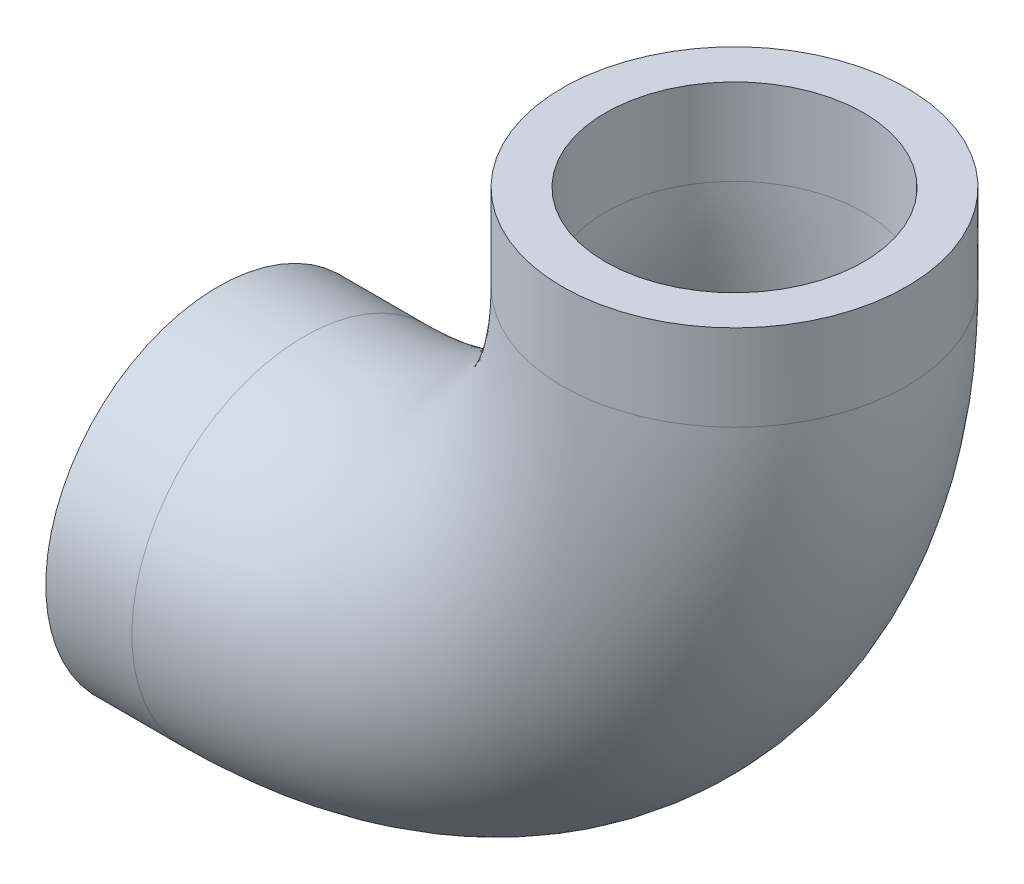
ISO-10303-21;
HEADER;
FILE_DESCRIPTION(('STEP AP214'),'2;1');
FILE_NAME('part.step','',(''),(''),'','','');
FILE_SCHEMA(('AUTOMOTIVE_DESIGN { 1 0 10303 214 1 1 1 1 }'));
ENDSEC;
DATA;
#1=APPLICATION_CONTEXT('core data for automotive mechanical design processes');
#2=APPLICATION_PROTOCOL_DEFINITION('international standard','automotive_design',2000,#1);
#3=PRODUCT_CONTEXT('',#1,'mechanical');
#4=PRODUCT('Part','Part','',(#3));
#5=PRODUCT_RELATED_PRODUCT_CATEGORY('part','',(#4));
#6=PRODUCT_DEFINITION_FORMATION('','',#4);
#7=PRODUCT_DEFINITION_CONTEXT('part definition',#1,'design');
#8=PRODUCT_DEFINITION('design','',#6,#7);
#9=PRODUCT_DEFINITION_SHAPE('','',#8);
#10=(LENGTH_UNIT() NAMED_UNIT(*) SI_UNIT(.MILLI.,.METRE.));
#11=(NAMED_UNIT(*) PLANE_ANGLE_UNIT() SI_UNIT($,.RADIAN.));
#12=(NAMED_UNIT(*) SI_UNIT($,.STERADIAN.) SOLID_ANGLE_UNIT());
#13=UNCERTAINTY_MEASURE_WITH_UNIT(LENGTH_MEASURE(1.E-05),#10,'distance_accuracy_value','');
#14=(GEOMETRIC_REPRESENTATION_CONTEXT(3) GLOBAL_UNCERTAINTY_ASSIGNED_CONTEXT((#13)) GLOBAL_UNIT_ASSIGNED_CONTEXT((#10,
#11,#12)) REPRESENTATION_CONTEXT('',''));
#15=CARTESIAN_POINT('',(0.,0.,0.));
#16=DIRECTION('',(0.,0.,1.));
#17=DIRECTION('',(1.,0.,0.));
#18=AXIS2_PLACEMENT_3D('',#15,#16,#17);
#19=CARTESIAN_POINT('',(6.35,31.75,0.));
#20=DIRECTION('',(0.,0.,1.));
#21=DIRECTION('',(0.,1.,0.));
#22=AXIS2_PLACEMENT_3D('',#19,#20,#21);
#23=TOROIDAL_SURFACE('',#22,31.75,9.525);
#24=CARTESIAN_POINT('',(38.1,31.75,0.));
#25=DIRECTION('',(0.,1.,0.));
#26=DIRECTION('',(0.,0.,1.));
#27=AXIS2_PLACEMENT_3D('',#24,#25,#26);
#28=CIRCLE('',#27,9.525);
#29=CARTESIAN_POINT('',(38.1,31.75,9.525));
#30=VERTEX_POINT('',#29);
#31=EDGE_CURVE('E34',#30,#30,#28,.T.);
#32=ORIENTED_EDGE('',*,*,#31,.T.);
#33=EDGE_LOOP('',(#32));
#34=FACE_BOUND('',#33,.T.);
#35=CARTESIAN_POINT('',(6.35,0.,0.));
#36=DIRECTION('',(1.,0.,0.));
#37=DIRECTION('',(0.,0.,-1.));
#38=AXIS2_PLACEMENT_3D('',#35,#36,#37);
#39=CIRCLE('',#38,9.525);
#40=CARTESIAN_POINT('',(6.35,0.,-9.525));
#41=VERTEX_POINT('',#40);
#42=EDGE_CURVE('E32',#41,#41,#39,.F.);
#43=ORIENTED_EDGE('',*,*,#42,.T.);
#44=EDGE_LOOP('',(#43));
#45=FACE_BOUND('',#44,.T.);
#46=ADVANCED_FACE('F14',(#34,#45),#23,.F.);
#47=CARTESIAN_POINT('',(38.1,31.75,0.));
#48=DIRECTION('',(0.,1.,0.));
#49=DIRECTION('',(0.,0.,1.));
#50=AXIS2_PLACEMENT_3D('',#47,#48,#49);
#51=CYLINDRICAL_SURFACE('',#50,9.525);
#52=CARTESIAN_POINT('',(38.1,38.1,0.));
#53=DIRECTION('',(0.,1.,0.));
#54=DIRECTION('',(0.,0.,1.));
#55=AXIS2_PLACEMENT_3D('',#52,#53,#54);
#56=CIRCLE('',#55,9.525);
#57=CARTESIAN_POINT('',(38.1,38.1,9.525));
#58=VERTEX_POINT('',#57);
#59=EDGE_CURVE('E18',#58,#58,#56,.F.);
#60=ORIENTED_EDGE('',*,*,#59,.F.);
#61=EDGE_LOOP('',(#60));
#62=FACE_BOUND('',#61,.T.);
#63=ORIENTED_EDGE('',*,*,#31,.F.);
#64=EDGE_LOOP('',(#63));
#65=FACE_BOUND('',#64,.T.);
#66=ADVANCED_FACE('F53',(#62,#65),#51,.F.);
#67=CARTESIAN_POINT('',(0.,0.,0.));
#68=DIRECTION('',(1.,0.,0.));
#69=DIRECTION('',(0.,0.,-1.));
#70=AXIS2_PLACEMENT_3D('',#67,#68,#69);
#71=CYLINDRICAL_SURFACE('',#70,9.525);
#72=ORIENTED_EDGE('',*,*,#42,.F.);
#73=EDGE_LOOP('',(#72));
#74=FACE_BOUND('',#73,.T.);
#75=CARTESIAN_POINT('',(0.,0.,0.));
#76=DIRECTION('',(1.,0.,0.));
#77=DIRECTION('',(0.,0.,-1.));
#78=AXIS2_PLACEMENT_3D('',#75,#76,#77);
#79=CIRCLE('',#78,9.525);
#80=CARTESIAN_POINT('',(0.,0.,-9.525));
#81=VERTEX_POINT('',#80);
#82=EDGE_CURVE('E43',#81,#81,#79,.F.);
#83=ORIENTED_EDGE('',*,*,#82,.T.);
#84=EDGE_LOOP('',(#83));
#85=FACE_BOUND('',#84,.T.);
#86=ADVANCED_FACE('F56',(#74,#85),#71,.F.);
#87=CARTESIAN_POINT('',(38.1,38.1,0.));
#88=DIRECTION('',(0.,1.,0.));
#89=DIRECTION('',(0.,0.,1.));
#90=AXIS2_PLACEMENT_3D('',#87,#88,#89);
#91=PLANE('',#90);
#92=ORIENTED_EDGE('',*,*,#59,.T.);
#93=EDGE_LOOP('',(#92));
#94=FACE_BOUND('',#93,.T.);
#95=CARTESIAN_POINT('',(38.1,38.1,0.));
#96=DIRECTION('',(0.,1.,0.));
#97=DIRECTION('',(0.,0.,1.));
#98=AXIS2_PLACEMENT_3D('',#95,#96,#97);
#99=CIRCLE('',#98,12.7);
#100=CARTESIAN_POINT('',(38.1,38.1,12.7));
#101=VERTEX_POINT('',#100);
#102=EDGE_CURVE('E41',#101,#101,#99,.F.);
#103=ORIENTED_EDGE('',*,*,#102,.F.);
#104=EDGE_LOOP('',(#103));
#105=FACE_BOUND('',#104,.T.);
#106=ADVANCED_FACE('F50',(#94,#105),#91,.T.);
#107=CARTESIAN_POINT('',(0.,0.,0.));
#108=DIRECTION('',(1.,0.,0.));
#109=DIRECTION('',(0.,0.,-1.));
#110=AXIS2_PLACEMENT_3D('',#107,#108,#109);
#111=PLANE('',#110);
#112=ORIENTED_EDGE('',*,*,#82,.F.);
#113=EDGE_LOOP('',(#112));
#114=FACE_BOUND('',#113,.T.);
#115=CARTESIAN_POINT('',(0.,0.,0.));
#116=DIRECTION('',(1.,0.,0.));
#117=DIRECTION('',(0.,0.,-1.));
#118=AXIS2_PLACEMENT_3D('',#115,#116,#117);
#119=CIRCLE('',#118,12.7);
#120=CARTESIAN_POINT('',(0.,0.,-12.7));
#121=VERTEX_POINT('',#120);
#122=EDGE_CURVE('E27',#121,#121,#119,.T.);
#123=ORIENTED_EDGE('',*,*,#122,.F.);
#124=EDGE_LOOP('',(#123));
#125=FACE_BOUND('',#124,.T.);
#126=ADVANCED_FACE('F69',(#114,#125),#111,.F.);
#127=CARTESIAN_POINT('',(38.1,31.75,0.));
#128=DIRECTION('',(0.,1.,0.));
#129=DIRECTION('',(0.,0.,1.));
#130=AXIS2_PLACEMENT_3D('',#127,#128,#129);
#131=CYLINDRICAL_SURFACE('',#130,12.7);
#132=ORIENTED_EDGE('',*,*,#102,.T.);
#133=EDGE_LOOP('',(#132));
#134=FACE_BOUND('',#133,.T.);
#135=CARTESIAN_POINT('',(38.1,31.75,0.));
#136=DIRECTION('',(0.,1.,0.));
#137=DIRECTION('',(1.,0.,0.));
#138=AXIS2_PLACEMENT_3D('',#135,#136,#137);
#139=CIRCLE('',#138,12.7);
#140=CARTESIAN_POINT('',(50.8,31.75,0.));
#141=VERTEX_POINT('',#140);
#142=EDGE_CURVE('E22',#141,#141,#139,.F.);
#143=ORIENTED_EDGE('',*,*,#142,.F.);
#144=EDGE_LOOP('',(#143));
#145=FACE_BOUND('',#144,.T.);
#146=ADVANCED_FACE('F79',(#134,#145),#131,.T.);
#147=CARTESIAN_POINT('',(0.,0.,0.));
#148=DIRECTION('',(1.,0.,0.));
#149=DIRECTION('',(0.,0.,-1.));
#150=AXIS2_PLACEMENT_3D('',#147,#148,#149);
#151=CYLINDRICAL_SURFACE('',#150,12.7);
#152=CARTESIAN_POINT('',(6.35,0.,0.));
#153=DIRECTION('',(1.,0.,0.));
#154=DIRECTION('',(0.,-1.,0.));
#155=AXIS2_PLACEMENT_3D('',#152,#153,#154);
#156=CIRCLE('',#155,12.7);
#157=CARTESIAN_POINT('',(6.34999999999999,-12.7,0.));
#158=VERTEX_POINT('',#157);
#159=EDGE_CURVE('E10',#158,#158,#156,.T.);
#160=ORIENTED_EDGE('',*,*,#159,.F.);
#161=EDGE_LOOP('',(#160));
#162=FACE_BOUND('',#161,.T.);
#163=ORIENTED_EDGE('',*,*,#122,.T.);
#164=EDGE_LOOP('',(#163));
#165=FACE_BOUND('',#164,.T.);
#166=ADVANCED_FACE('F73',(#162,#165),#151,.T.);
#167=CARTESIAN_POINT('',(6.35,31.75,0.));
#168=DIRECTION('',(0.,0.,1.));
#169=DIRECTION('',(0.,1.,0.));
#170=AXIS2_PLACEMENT_3D('',#167,#168,#169);
#171=TOROIDAL_SURFACE('',#170,31.75,12.7);
#172=ORIENTED_EDGE('',*,*,#142,.T.);
#173=EDGE_LOOP('',(#172));
#174=FACE_BOUND('',#173,.T.);
#175=ORIENTED_EDGE('',*,*,#159,.T.);
#176=EDGE_LOOP('',(#175));
#177=FACE_BOUND('',#176,.T.);
#178=ADVANCED_FACE('F71',(#174,#177),#171,.T.);
#179=CLOSED_SHELL('',(#46,#66,#86,#106,#126,#146,#166,#178));
#180=MANIFOLD_SOLID_BREP('B1',#179);
#181=ADVANCED_BREP_SHAPE_REPRESENTATION('',(#18,#180),#14);
#182=SHAPE_DEFINITION_REPRESENTATION(#9,#181);
ENDSEC;
END-ISO-10303-21;
